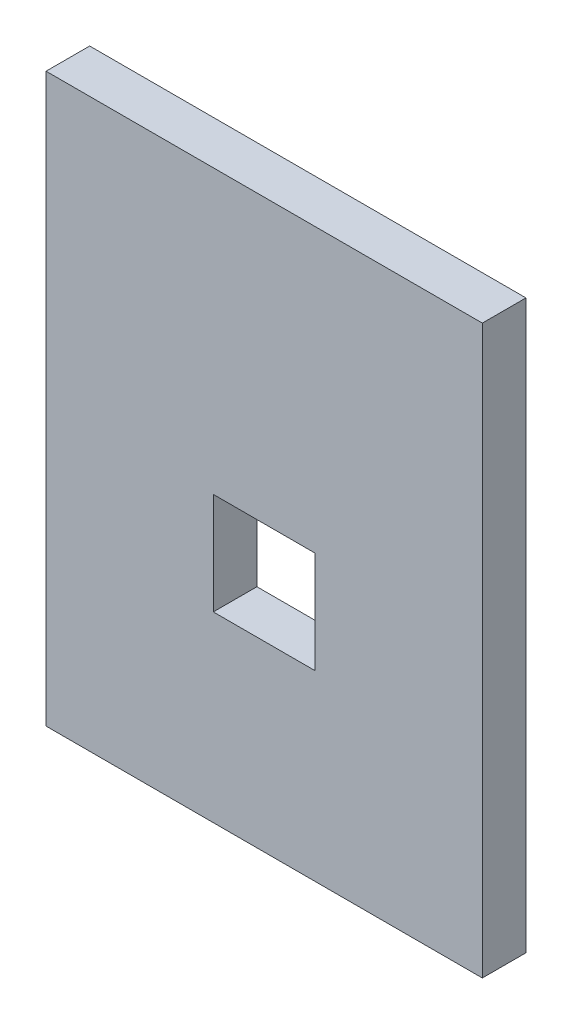
ISO-10303-21;
HEADER;
FILE_DESCRIPTION(('STEP AP214'),'2;1');
FILE_NAME('part.step','',(''),(''),'','','');
FILE_SCHEMA(('AUTOMOTIVE_DESIGN { 1 0 10303 214 1 1 1 1 }'));
ENDSEC;
DATA;
#1=APPLICATION_CONTEXT('core data for automotive mechanical design processes');
#2=APPLICATION_PROTOCOL_DEFINITION('international standard','automotive_design',2000,#1);
#3=PRODUCT_CONTEXT('',#1,'mechanical');
#4=PRODUCT('Part','Part','',(#3));
#5=PRODUCT_RELATED_PRODUCT_CATEGORY('part','',(#4));
#6=PRODUCT_DEFINITION_FORMATION('','',#4);
#7=PRODUCT_DEFINITION_CONTEXT('part definition',#1,'design');
#8=PRODUCT_DEFINITION('design','',#6,#7);
#9=PRODUCT_DEFINITION_SHAPE('','',#8);
#10=(LENGTH_UNIT() NAMED_UNIT(*) SI_UNIT(.MILLI.,.METRE.));
#11=(NAMED_UNIT(*) PLANE_ANGLE_UNIT() SI_UNIT($,.RADIAN.));
#12=(NAMED_UNIT(*) SI_UNIT($,.STERADIAN.) SOLID_ANGLE_UNIT());
#13=UNCERTAINTY_MEASURE_WITH_UNIT(LENGTH_MEASURE(1.E-05),#10,'distance_accuracy_value','');
#14=(GEOMETRIC_REPRESENTATION_CONTEXT(3) GLOBAL_UNCERTAINTY_ASSIGNED_CONTEXT((#13)) GLOBAL_UNIT_ASSIGNED_CONTEXT((#10,
#11,#12)) REPRESENTATION_CONTEXT('',''));
#15=CARTESIAN_POINT('',(0.,0.,0.));
#16=DIRECTION('',(0.,0.,1.));
#17=DIRECTION('',(1.,0.,0.));
#18=AXIS2_PLACEMENT_3D('',#15,#16,#17);
#19=CARTESIAN_POINT('',(0.,0.,19.05));
#20=DIRECTION('',(0.,0.,-1.));
#21=DIRECTION('',(-1.,0.,0.));
#22=AXIS2_PLACEMENT_3D('',#19,#20,#21);
#23=PLANE('',#22);
#24=DIRECTION('',(0.,1.,0.));
#25=VECTOR('',#24,1.);
#26=CARTESIAN_POINT('',(95.25,-123.825,19.05));
#27=LINE('',#26,#25);
#28=CARTESIAN_POINT('',(95.25,-123.825,19.05));
#29=VERTEX_POINT('',#28);
#30=CARTESIAN_POINT('',(95.25,123.825,19.05));
#31=VERTEX_POINT('',#30);
#32=EDGE_CURVE('E153',#29,#31,#27,.T.);
#33=ORIENTED_EDGE('',*,*,#32,.T.);
#34=DIRECTION('',(-1.,0.,0.));
#35=VECTOR('',#34,1.);
#36=CARTESIAN_POINT('',(-95.25,123.825,19.05));
#37=LINE('',#36,#35);
#38=CARTESIAN_POINT('',(-95.25,123.825,19.05));
#39=VERTEX_POINT('',#38);
#40=EDGE_CURVE('E157',#31,#39,#37,.T.);
#41=ORIENTED_EDGE('',*,*,#40,.T.);
#42=DIRECTION('',(0.,-1.,0.));
#43=VECTOR('',#42,1.);
#44=CARTESIAN_POINT('',(-95.25,-123.825,19.05));
#45=LINE('',#44,#43);
#46=CARTESIAN_POINT('',(-95.25,-123.825,19.05));
#47=VERTEX_POINT('',#46);
#48=EDGE_CURVE('E161',#39,#47,#45,.T.);
#49=ORIENTED_EDGE('',*,*,#48,.T.);
#50=DIRECTION('',(1.,0.,0.));
#51=VECTOR('',#50,1.);
#52=CARTESIAN_POINT('',(-95.25,-123.825,19.05));
#53=LINE('',#52,#51);
#54=EDGE_CURVE('E164',#47,#29,#53,.T.);
#55=ORIENTED_EDGE('',*,*,#54,.T.);
#56=EDGE_LOOP('',(#33,#41,#49,#55));
#57=FACE_BOUND('',#56,.T.);
#58=DIRECTION('',(0.,1.,0.));
#59=VECTOR('',#58,1.);
#60=CARTESIAN_POINT('',(22.225,-44.1325,19.05));
#61=LINE('',#60,#59);
#62=CARTESIAN_POINT('',(22.225,-44.1325,19.05));
#63=VERTEX_POINT('',#62);
#64=CARTESIAN_POINT('',(22.225,0.317499999999998,19.05));
#65=VERTEX_POINT('',#64);
#66=EDGE_CURVE('E105',#63,#65,#61,.T.);
#67=ORIENTED_EDGE('',*,*,#66,.F.);
#68=DIRECTION('',(1.,0.,0.));
#69=VECTOR('',#68,1.);
#70=CARTESIAN_POINT('',(-22.225,-44.1325,19.05));
#71=LINE('',#70,#69);
#72=CARTESIAN_POINT('',(-22.225,-44.1325,19.05));
#73=VERTEX_POINT('',#72);
#74=EDGE_CURVE('E131',#73,#63,#71,.T.);
#75=ORIENTED_EDGE('',*,*,#74,.F.);
#76=DIRECTION('',(0.,-1.,0.));
#77=VECTOR('',#76,1.);
#78=CARTESIAN_POINT('',(-22.225,-44.1325,19.05));
#79=LINE('',#78,#77);
#80=CARTESIAN_POINT('',(-22.225,0.317499999999998,19.05));
#81=VERTEX_POINT('',#80);
#82=EDGE_CURVE('E127',#81,#73,#79,.T.);
#83=ORIENTED_EDGE('',*,*,#82,.F.);
#84=DIRECTION('',(-1.,0.,0.));
#85=VECTOR('',#84,1.);
#86=CARTESIAN_POINT('',(-22.225,0.317499999999998,19.05));
#87=LINE('',#86,#85);
#88=EDGE_CURVE('E114',#65,#81,#87,.T.);
#89=ORIENTED_EDGE('',*,*,#88,.F.);
#90=EDGE_LOOP('',(#67,#75,#83,#89));
#91=FACE_BOUND('',#90,.T.);
#92=ADVANCED_FACE('F39',(#57,#91),#23,.F.);
#93=CARTESIAN_POINT('',(0.,0.,0.));
#94=DIRECTION('',(0.,0.,-1.));
#95=DIRECTION('',(-1.,0.,0.));
#96=AXIS2_PLACEMENT_3D('',#93,#94,#95);
#97=PLANE('',#96);
#98=DIRECTION('',(0.,1.,0.));
#99=VECTOR('',#98,1.);
#100=CARTESIAN_POINT('',(95.25,-123.825,0.));
#101=LINE('',#100,#99);
#102=CARTESIAN_POINT('',(95.25,-123.825,0.));
#103=VERTEX_POINT('',#102);
#104=CARTESIAN_POINT('',(95.25,123.825,0.));
#105=VERTEX_POINT('',#104);
#106=EDGE_CURVE('E123',#103,#105,#101,.T.);
#107=ORIENTED_EDGE('',*,*,#106,.F.);
#108=DIRECTION('',(1.,0.,0.));
#109=VECTOR('',#108,1.);
#110=CARTESIAN_POINT('',(-95.25,-123.825,0.));
#111=LINE('',#110,#109);
#112=CARTESIAN_POINT('',(-95.25,-123.825,0.));
#113=VERTEX_POINT('',#112);
#114=EDGE_CURVE('E158',#113,#103,#111,.T.);
#115=ORIENTED_EDGE('',*,*,#114,.F.);
#116=DIRECTION('',(0.,-1.,0.));
#117=VECTOR('',#116,1.);
#118=CARTESIAN_POINT('',(-95.25,-123.825,0.));
#119=LINE('',#118,#117);
#120=CARTESIAN_POINT('',(-95.25,123.825,0.));
#121=VERTEX_POINT('',#120);
#122=EDGE_CURVE('E174',#121,#113,#119,.T.);
#123=ORIENTED_EDGE('',*,*,#122,.F.);
#124=DIRECTION('',(-1.,0.,0.));
#125=VECTOR('',#124,1.);
#126=CARTESIAN_POINT('',(-95.25,123.825,0.));
#127=LINE('',#126,#125);
#128=EDGE_CURVE('E171',#105,#121,#127,.T.);
#129=ORIENTED_EDGE('',*,*,#128,.F.);
#130=EDGE_LOOP('',(#107,#115,#123,#129));
#131=FACE_BOUND('',#130,.T.);
#132=DIRECTION('',(1.,0.,0.));
#133=VECTOR('',#132,1.);
#134=CARTESIAN_POINT('',(-22.225,-44.1325,0.));
#135=LINE('',#134,#133);
#136=CARTESIAN_POINT('',(-22.225,-44.1325,0.));
#137=VERTEX_POINT('',#136);
#138=CARTESIAN_POINT('',(22.225,-44.1325,0.));
#139=VERTEX_POINT('',#138);
#140=EDGE_CURVE('E115',#137,#139,#135,.T.);
#141=ORIENTED_EDGE('',*,*,#140,.T.);
#142=DIRECTION('',(0.,1.,0.));
#143=VECTOR('',#142,1.);
#144=CARTESIAN_POINT('',(22.225,-44.1325,0.));
#145=LINE('',#144,#143);
#146=CARTESIAN_POINT('',(22.225,0.317499999999998,0.));
#147=VERTEX_POINT('',#146);
#148=EDGE_CURVE('E63',#139,#147,#145,.T.);
#149=ORIENTED_EDGE('',*,*,#148,.T.);
#150=DIRECTION('',(-1.,0.,0.));
#151=VECTOR('',#150,1.);
#152=CARTESIAN_POINT('',(-22.225,0.317499999999998,0.));
#153=LINE('',#152,#151);
#154=CARTESIAN_POINT('',(-22.225,0.317499999999998,0.));
#155=VERTEX_POINT('',#154);
#156=EDGE_CURVE('E121',#147,#155,#153,.T.);
#157=ORIENTED_EDGE('',*,*,#156,.T.);
#158=DIRECTION('',(0.,-1.,0.));
#159=VECTOR('',#158,1.);
#160=CARTESIAN_POINT('',(-22.225,-44.1325,0.));
#161=LINE('',#160,#159);
#162=EDGE_CURVE('E140',#155,#137,#161,.T.);
#163=ORIENTED_EDGE('',*,*,#162,.T.);
#164=EDGE_LOOP('',(#141,#149,#157,#163));
#165=FACE_BOUND('',#164,.T.);
#166=ADVANCED_FACE('F197',(#131,#165),#97,.T.);
#167=CARTESIAN_POINT('',(95.25,-123.825,19.05));
#168=DIRECTION('',(-1.,0.,0.));
#169=DIRECTION('',(0.,0.,1.));
#170=AXIS2_PLACEMENT_3D('',#167,#168,#169);
#171=PLANE('',#170);
#172=ORIENTED_EDGE('',*,*,#106,.T.);
#173=DIRECTION('',(0.,0.,-1.));
#174=VECTOR('',#173,1.);
#175=CARTESIAN_POINT('',(95.25,123.825,19.05));
#176=LINE('',#175,#174);
#177=EDGE_CURVE('E11',#31,#105,#176,.T.);
#178=ORIENTED_EDGE('',*,*,#177,.F.);
#179=ORIENTED_EDGE('',*,*,#32,.F.);
#180=DIRECTION('',(0.,0.,-1.));
#181=VECTOR('',#180,1.);
#182=CARTESIAN_POINT('',(95.25,-123.825,19.05));
#183=LINE('',#182,#181);
#184=EDGE_CURVE('E167',#29,#103,#183,.T.);
#185=ORIENTED_EDGE('',*,*,#184,.T.);
#186=EDGE_LOOP('',(#172,#178,#179,#185));
#187=FACE_BOUND('',#186,.T.);
#188=ADVANCED_FACE('F41',(#187),#171,.F.);
#189=CARTESIAN_POINT('',(-95.25,123.825,19.05));
#190=DIRECTION('',(0.,-1.,0.));
#191=DIRECTION('',(0.,0.,-1.));
#192=AXIS2_PLACEMENT_3D('',#189,#190,#191);
#193=PLANE('',#192);
#194=ORIENTED_EDGE('',*,*,#128,.T.);
#195=DIRECTION('',(0.,0.,-1.));
#196=VECTOR('',#195,1.);
#197=CARTESIAN_POINT('',(-95.25,123.825,19.05));
#198=LINE('',#197,#196);
#199=EDGE_CURVE('E48',#39,#121,#198,.T.);
#200=ORIENTED_EDGE('',*,*,#199,.F.);
#201=ORIENTED_EDGE('',*,*,#40,.F.);
#202=ORIENTED_EDGE('',*,*,#177,.T.);
#203=EDGE_LOOP('',(#194,#200,#201,#202));
#204=FACE_BOUND('',#203,.T.);
#205=ADVANCED_FACE('F207',(#204),#193,.F.);
#206=CARTESIAN_POINT('',(-95.25,-123.825,19.05));
#207=DIRECTION('',(1.,0.,0.));
#208=DIRECTION('',(0.,0.,-1.));
#209=AXIS2_PLACEMENT_3D('',#206,#207,#208);
#210=PLANE('',#209);
#211=ORIENTED_EDGE('',*,*,#122,.T.);
#212=DIRECTION('',(0.,0.,-1.));
#213=VECTOR('',#212,1.);
#214=CARTESIAN_POINT('',(-95.25,-123.825,19.05));
#215=LINE('',#214,#213);
#216=EDGE_CURVE('E182',#47,#113,#215,.T.);
#217=ORIENTED_EDGE('',*,*,#216,.F.);
#218=ORIENTED_EDGE('',*,*,#48,.F.);
#219=ORIENTED_EDGE('',*,*,#199,.T.);
#220=EDGE_LOOP('',(#211,#217,#218,#219));
#221=FACE_BOUND('',#220,.T.);
#222=ADVANCED_FACE('F191',(#221),#210,.F.);
#223=CARTESIAN_POINT('',(-95.25,-123.825,19.05));
#224=DIRECTION('',(0.,1.,0.));
#225=DIRECTION('',(0.,0.,1.));
#226=AXIS2_PLACEMENT_3D('',#223,#224,#225);
#227=PLANE('',#226);
#228=ORIENTED_EDGE('',*,*,#114,.T.);
#229=ORIENTED_EDGE('',*,*,#184,.F.);
#230=ORIENTED_EDGE('',*,*,#54,.F.);
#231=ORIENTED_EDGE('',*,*,#216,.T.);
#232=EDGE_LOOP('',(#228,#229,#230,#231));
#233=FACE_BOUND('',#232,.T.);
#234=ADVANCED_FACE('F201',(#233),#227,.F.);
#235=CARTESIAN_POINT('',(22.225,-44.1325,19.05));
#236=DIRECTION('',(-1.,0.,0.));
#237=DIRECTION('',(0.,0.,1.));
#238=AXIS2_PLACEMENT_3D('',#235,#236,#237);
#239=PLANE('',#238);
#240=ORIENTED_EDGE('',*,*,#148,.F.);
#241=DIRECTION('',(0.,0.,-1.));
#242=VECTOR('',#241,1.);
#243=CARTESIAN_POINT('',(22.225,-44.1325,19.05));
#244=LINE('',#243,#242);
#245=EDGE_CURVE('E109',#63,#139,#244,.T.);
#246=ORIENTED_EDGE('',*,*,#245,.F.);
#247=ORIENTED_EDGE('',*,*,#66,.T.);
#248=DIRECTION('',(0.,0.,-1.));
#249=VECTOR('',#248,1.);
#250=CARTESIAN_POINT('',(22.225,0.317499999999998,19.05));
#251=LINE('',#250,#249);
#252=EDGE_CURVE('E108',#65,#147,#251,.T.);
#253=ORIENTED_EDGE('',*,*,#252,.T.);
#254=EDGE_LOOP('',(#240,#246,#247,#253));
#255=FACE_BOUND('',#254,.T.);
#256=ADVANCED_FACE('F107',(#255),#239,.T.);
#257=CARTESIAN_POINT('',(-22.225,0.317499999999998,19.05));
#258=DIRECTION('',(0.,-1.,0.));
#259=DIRECTION('',(0.,0.,-1.));
#260=AXIS2_PLACEMENT_3D('',#257,#258,#259);
#261=PLANE('',#260);
#262=ORIENTED_EDGE('',*,*,#156,.F.);
#263=ORIENTED_EDGE('',*,*,#252,.F.);
#264=ORIENTED_EDGE('',*,*,#88,.T.);
#265=DIRECTION('',(0.,0.,-1.));
#266=VECTOR('',#265,1.);
#267=CARTESIAN_POINT('',(-22.225,0.317499999999998,19.05));
#268=LINE('',#267,#266);
#269=EDGE_CURVE('E124',#81,#155,#268,.T.);
#270=ORIENTED_EDGE('',*,*,#269,.T.);
#271=EDGE_LOOP('',(#262,#263,#264,#270));
#272=FACE_BOUND('',#271,.T.);
#273=ADVANCED_FACE('F118',(#272),#261,.T.);
#274=CARTESIAN_POINT('',(-22.225,-44.1325,19.05));
#275=DIRECTION('',(1.,0.,0.));
#276=DIRECTION('',(0.,0.,-1.));
#277=AXIS2_PLACEMENT_3D('',#274,#275,#276);
#278=PLANE('',#277);
#279=ORIENTED_EDGE('',*,*,#162,.F.);
#280=ORIENTED_EDGE('',*,*,#269,.F.);
#281=ORIENTED_EDGE('',*,*,#82,.T.);
#282=DIRECTION('',(0.,0.,-1.));
#283=VECTOR('',#282,1.);
#284=CARTESIAN_POINT('',(-22.225,-44.1325,19.05));
#285=LINE('',#284,#283);
#286=EDGE_CURVE('E55',#73,#137,#285,.T.);
#287=ORIENTED_EDGE('',*,*,#286,.T.);
#288=EDGE_LOOP('',(#279,#280,#281,#287));
#289=FACE_BOUND('',#288,.T.);
#290=ADVANCED_FACE('F230',(#289),#278,.T.);
#291=CARTESIAN_POINT('',(-22.225,-44.1325,19.05));
#292=DIRECTION('',(0.,1.,0.));
#293=DIRECTION('',(0.,0.,1.));
#294=AXIS2_PLACEMENT_3D('',#291,#292,#293);
#295=PLANE('',#294);
#296=ORIENTED_EDGE('',*,*,#140,.F.);
#297=ORIENTED_EDGE('',*,*,#286,.F.);
#298=ORIENTED_EDGE('',*,*,#74,.T.);
#299=ORIENTED_EDGE('',*,*,#245,.T.);
#300=EDGE_LOOP('',(#296,#297,#298,#299));
#301=FACE_BOUND('',#300,.T.);
#302=ADVANCED_FACE('F234',(#301),#295,.T.);
#303=CLOSED_SHELL('',(#92,#166,#188,#205,#222,#234,#256,#273,#290,#302));
#304=MANIFOLD_SOLID_BREP('B2',#303);
#305=ADVANCED_BREP_SHAPE_REPRESENTATION('',(#18,#304),#14);
#306=SHAPE_DEFINITION_REPRESENTATION(#9,#305);
ENDSEC;
END-ISO-10303-21;
